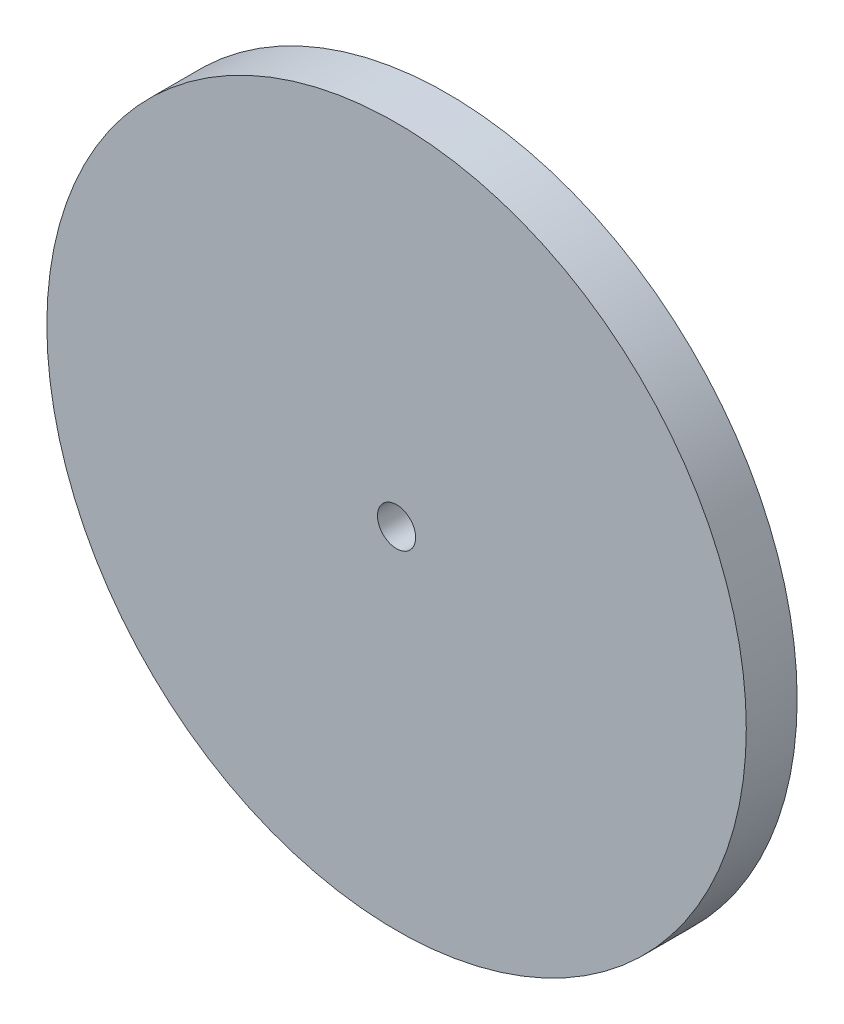
ISO-10303-21;
HEADER;
FILE_DESCRIPTION(('STEP AP214'),'2;1');
FILE_NAME('part.step','',(''),(''),'','','');
FILE_SCHEMA(('AUTOMOTIVE_DESIGN { 1 0 10303 214 1 1 1 1 }'));
ENDSEC;
DATA;
#1=APPLICATION_CONTEXT('core data for automotive mechanical design processes');
#2=APPLICATION_PROTOCOL_DEFINITION('international standard','automotive_design',2000,#1);
#3=PRODUCT_CONTEXT('',#1,'mechanical');
#4=PRODUCT('Part','Part','',(#3));
#5=PRODUCT_RELATED_PRODUCT_CATEGORY('part','',(#4));
#6=PRODUCT_DEFINITION_FORMATION('','',#4);
#7=PRODUCT_DEFINITION_CONTEXT('part definition',#1,'design');
#8=PRODUCT_DEFINITION('design','',#6,#7);
#9=PRODUCT_DEFINITION_SHAPE('','',#8);
#10=(LENGTH_UNIT() NAMED_UNIT(*) SI_UNIT(.MILLI.,.METRE.));
#11=(NAMED_UNIT(*) PLANE_ANGLE_UNIT() SI_UNIT($,.RADIAN.));
#12=(NAMED_UNIT(*) SI_UNIT($,.STERADIAN.) SOLID_ANGLE_UNIT());
#13=UNCERTAINTY_MEASURE_WITH_UNIT(LENGTH_MEASURE(1.E-05),#10,'distance_accuracy_value','');
#14=(GEOMETRIC_REPRESENTATION_CONTEXT(3) GLOBAL_UNCERTAINTY_ASSIGNED_CONTEXT((#13)) GLOBAL_UNIT_ASSIGNED_CONTEXT((#10,
#11,#12)) REPRESENTATION_CONTEXT('',''));
#15=CARTESIAN_POINT('',(0.,0.,0.));
#16=DIRECTION('',(0.,0.,1.));
#17=DIRECTION('',(1.,0.,0.));
#18=AXIS2_PLACEMENT_3D('',#15,#16,#17);
#19=CARTESIAN_POINT('',(0.,0.,2.54));
#20=DIRECTION('',(0.,0.,1.));
#21=DIRECTION('',(1.,0.,0.));
#22=AXIS2_PLACEMENT_3D('',#19,#20,#21);
#23=PLANE('',#22);
#24=CARTESIAN_POINT('',(0.,0.,2.54));
#25=DIRECTION('',(0.,0.,1.));
#26=DIRECTION('',(1.,0.,0.));
#27=AXIS2_PLACEMENT_3D('',#24,#25,#26);
#28=CIRCLE('',#27,17.4625);
#29=CARTESIAN_POINT('',(17.4625,0.,2.54));
#30=VERTEX_POINT('',#29);
#31=EDGE_CURVE('E10',#30,#30,#28,.T.);
#32=ORIENTED_EDGE('',*,*,#31,.T.);
#33=EDGE_LOOP('',(#32));
#34=FACE_BOUND('',#33,.T.);
#35=CARTESIAN_POINT('',(0.,0.,2.54));
#36=DIRECTION('',(0.,0.,1.));
#37=DIRECTION('',(1.,0.,0.));
#38=AXIS2_PLACEMENT_3D('',#35,#36,#37);
#39=CIRCLE('',#38,0.9525);
#40=CARTESIAN_POINT('',(0.9525,0.,2.54));
#41=VERTEX_POINT('',#40);
#42=EDGE_CURVE('E44',#41,#41,#39,.T.);
#43=ORIENTED_EDGE('',*,*,#42,.F.);
#44=EDGE_LOOP('',(#43));
#45=FACE_BOUND('',#44,.T.);
#46=ADVANCED_FACE('F33',(#34,#45),#23,.T.);
#47=CARTESIAN_POINT('',(0.,0.,0.));
#48=DIRECTION('',(0.,0.,1.));
#49=DIRECTION('',(1.,0.,0.));
#50=AXIS2_PLACEMENT_3D('',#47,#48,#49);
#51=PLANE('',#50);
#52=CARTESIAN_POINT('',(0.,0.,0.));
#53=DIRECTION('',(0.,0.,1.));
#54=DIRECTION('',(1.,0.,0.));
#55=AXIS2_PLACEMENT_3D('',#52,#53,#54);
#56=CIRCLE('',#55,17.4625);
#57=CARTESIAN_POINT('',(17.4625,0.,0.));
#58=VERTEX_POINT('',#57);
#59=EDGE_CURVE('E37',#58,#58,#56,.T.);
#60=ORIENTED_EDGE('',*,*,#59,.F.);
#61=EDGE_LOOP('',(#60));
#62=FACE_BOUND('',#61,.T.);
#63=CARTESIAN_POINT('',(0.,0.,0.));
#64=DIRECTION('',(0.,0.,1.));
#65=DIRECTION('',(1.,0.,0.));
#66=AXIS2_PLACEMENT_3D('',#63,#64,#65);
#67=CIRCLE('',#66,0.9525);
#68=CARTESIAN_POINT('',(0.9525,0.,0.));
#69=VERTEX_POINT('',#68);
#70=EDGE_CURVE('E46',#69,#69,#67,.T.);
#71=ORIENTED_EDGE('',*,*,#70,.T.);
#72=EDGE_LOOP('',(#71));
#73=FACE_BOUND('',#72,.T.);
#74=ADVANCED_FACE('F56',(#62,#73),#51,.F.);
#75=CARTESIAN_POINT('',(0.,0.,2.54));
#76=DIRECTION('',(0.,0.,-1.));
#77=DIRECTION('',(-1.,0.,0.));
#78=AXIS2_PLACEMENT_3D('',#75,#76,#77);
#79=CYLINDRICAL_SURFACE('',#78,17.4625);
#80=ORIENTED_EDGE('',*,*,#31,.F.);
#81=EDGE_LOOP('',(#80));
#82=FACE_BOUND('',#81,.T.);
#83=ORIENTED_EDGE('',*,*,#59,.T.);
#84=EDGE_LOOP('',(#83));
#85=FACE_BOUND('',#84,.T.);
#86=ADVANCED_FACE('F35',(#82,#85),#79,.T.);
#87=CARTESIAN_POINT('',(0.,0.,2.54));
#88=DIRECTION('',(0.,0.,-1.));
#89=DIRECTION('',(-1.,0.,0.));
#90=AXIS2_PLACEMENT_3D('',#87,#88,#89);
#91=CYLINDRICAL_SURFACE('',#90,0.9525);
#92=ORIENTED_EDGE('',*,*,#42,.T.);
#93=EDGE_LOOP('',(#92));
#94=FACE_BOUND('',#93,.T.);
#95=ORIENTED_EDGE('',*,*,#70,.F.);
#96=EDGE_LOOP('',(#95));
#97=FACE_BOUND('',#96,.T.);
#98=ADVANCED_FACE('F52',(#94,#97),#91,.F.);
#99=CLOSED_SHELL('',(#46,#74,#86,#98));
#100=MANIFOLD_SOLID_BREP('B2',#99);
#101=ADVANCED_BREP_SHAPE_REPRESENTATION('',(#18,#100),#14);
#102=SHAPE_DEFINITION_REPRESENTATION(#9,#101);
ENDSEC;
END-ISO-10303-21;
